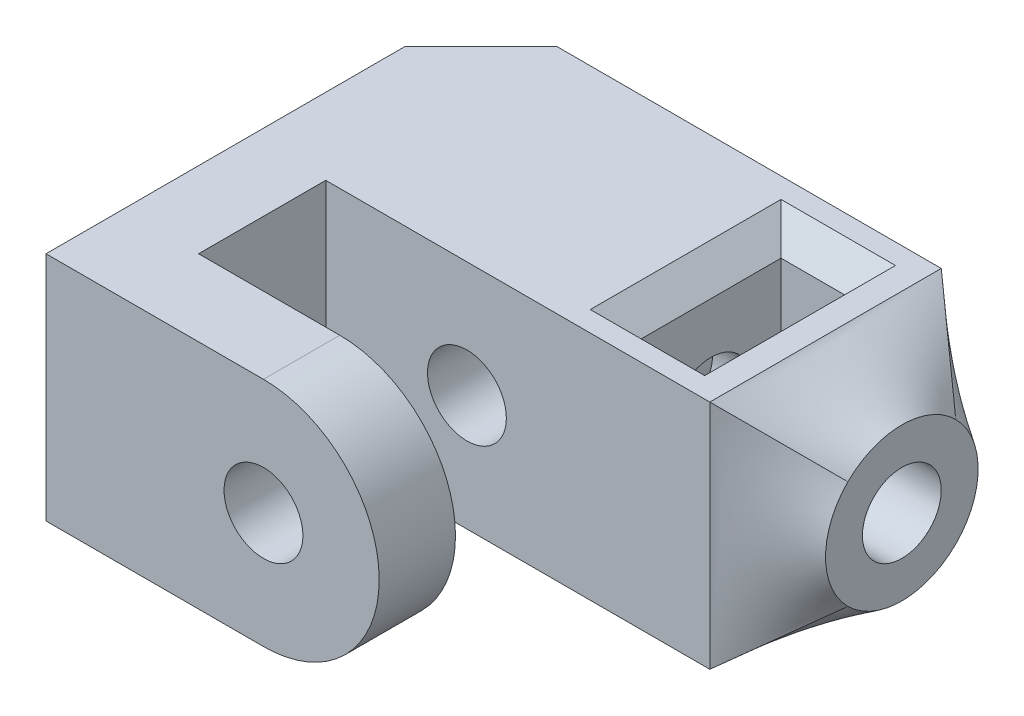
ISO-10303-21;
HEADER;
FILE_DESCRIPTION(('STEP AP214'),'2;1');
FILE_NAME('part.step','',(''),(''),'','','');
FILE_SCHEMA(('AUTOMOTIVE_DESIGN { 1 0 10303 214 1 1 1 1 }'));
ENDSEC;
DATA;
#1=APPLICATION_CONTEXT('core data for automotive mechanical design processes');
#2=APPLICATION_PROTOCOL_DEFINITION('international standard','automotive_design',2000,#1);
#3=PRODUCT_CONTEXT('',#1,'mechanical');
#4=PRODUCT('Part','Part','',(#3));
#5=PRODUCT_RELATED_PRODUCT_CATEGORY('part','',(#4));
#6=PRODUCT_DEFINITION_FORMATION('','',#4);
#7=PRODUCT_DEFINITION_CONTEXT('part definition',#1,'design');
#8=PRODUCT_DEFINITION('design','',#6,#7);
#9=PRODUCT_DEFINITION_SHAPE('','',#8);
#10=(LENGTH_UNIT() NAMED_UNIT(*) SI_UNIT(.MILLI.,.METRE.));
#11=(NAMED_UNIT(*) PLANE_ANGLE_UNIT() SI_UNIT($,.RADIAN.));
#12=(NAMED_UNIT(*) SI_UNIT($,.STERADIAN.) SOLID_ANGLE_UNIT());
#13=UNCERTAINTY_MEASURE_WITH_UNIT(LENGTH_MEASURE(1.E-05),#10,'distance_accuracy_value','');
#14=(GEOMETRIC_REPRESENTATION_CONTEXT(3) GLOBAL_UNCERTAINTY_ASSIGNED_CONTEXT((#13)) GLOBAL_UNIT_ASSIGNED_CONTEXT((#10,
#11,#12)) REPRESENTATION_CONTEXT('',''));
#15=CARTESIAN_POINT('',(0.,0.,0.));
#16=DIRECTION('',(0.,0.,1.));
#17=DIRECTION('',(1.,0.,0.));
#18=AXIS2_PLACEMENT_3D('',#15,#16,#17);
#19=CARTESIAN_POINT('',(-107.11518965689,2.50000000001586,-20.55));
#20=DIRECTION('',(1.,0.,0.));
#21=DIRECTION('',(0.,0.,1.));
#22=AXIS2_PLACEMENT_3D('',#19,#20,#21);
#23=CYLINDRICAL_SURFACE('',#22,1.55);
#24=CARTESIAN_POINT('',(-82.0141896568897,2.50000000001586,-20.55));
#25=DIRECTION('',(-1.,0.,0.));
#26=DIRECTION('',(0.,0.,1.));
#27=AXIS2_PLACEMENT_3D('',#24,#25,#26);
#28=CIRCLE('',#27,1.55);
#29=CARTESIAN_POINT('',(-82.0141896568897,2.50000000001586,-19.));
#30=VERTEX_POINT('',#29);
#31=EDGE_CURVE('E194',#30,#30,#28,.T.);
#32=ORIENTED_EDGE('',*,*,#31,.F.);
#33=EDGE_LOOP('',(#32));
#34=FACE_BOUND('',#33,.T.);
#35=CARTESIAN_POINT('',(-87.0141896568897,2.50000000001586,-20.55));
#36=DIRECTION('',(1.,0.,0.));
#37=DIRECTION('',(0.,0.,-1.));
#38=AXIS2_PLACEMENT_3D('',#35,#36,#37);
#39=CIRCLE('',#38,1.55);
#40=CARTESIAN_POINT('',(-87.0141896568897,2.50000000001586,-22.1));
#41=VERTEX_POINT('',#40);
#42=EDGE_CURVE('E373',#41,#41,#39,.T.);
#43=ORIENTED_EDGE('',*,*,#42,.F.);
#44=EDGE_LOOP('',(#43));
#45=FACE_BOUND('',#44,.T.);
#46=ADVANCED_FACE('F43',(#34,#45),#23,.F.);
#47=CARTESIAN_POINT('',(-100.11418965689,0.,-16.));
#48=DIRECTION('',(-1.,0.,0.));
#49=DIRECTION('',(0.,0.,-1.));
#50=AXIS2_PLACEMENT_3D('',#47,#48,#49);
#51=PLANE('',#50);
#52=DIRECTION('',(0.,1.,0.));
#53=VECTOR('',#52,1.);
#54=CARTESIAN_POINT('',(-100.11418965689,0.,-11.));
#55=LINE('',#54,#53);
#56=CARTESIAN_POINT('',(-100.11418965689,-2.04999999998414,-11.));
#57=VERTEX_POINT('',#56);
#58=CARTESIAN_POINT('',(-100.11418965689,7.05000000001586,-11.));
#59=VERTEX_POINT('',#58);
#60=EDGE_CURVE('E289',#57,#59,#55,.T.);
#61=ORIENTED_EDGE('',*,*,#60,.F.);
#62=DIRECTION('',(0.,0.,-1.));
#63=VECTOR('',#62,1.);
#64=CARTESIAN_POINT('',(-100.11418965689,-2.04999999998414,-8.));
#65=LINE('',#64,#63);
#66=CARTESIAN_POINT('',(-100.11418965689,-2.04999999998414,-16.));
#67=VERTEX_POINT('',#66);
#68=EDGE_CURVE('E299',#57,#67,#65,.T.);
#69=ORIENTED_EDGE('',*,*,#68,.T.);
#70=DIRECTION('',(0.,-1.,0.));
#71=VECTOR('',#70,1.);
#72=CARTESIAN_POINT('',(-100.11418965689,0.,-16.));
#73=LINE('',#72,#71);
#74=CARTESIAN_POINT('',(-100.11418965689,7.05000000001586,-16.));
#75=VERTEX_POINT('',#74);
#76=EDGE_CURVE('E416',#75,#67,#73,.T.);
#77=ORIENTED_EDGE('',*,*,#76,.F.);
#78=DIRECTION('',(0.,0.,1.));
#79=VECTOR('',#78,1.);
#80=CARTESIAN_POINT('',(-100.11418965689,7.05000000001586,-8.));
#81=LINE('',#80,#79);
#82=EDGE_CURVE('E303',#75,#59,#81,.T.);
#83=ORIENTED_EDGE('',*,*,#82,.T.);
#84=EDGE_LOOP('',(#61,#69,#77,#83));
#85=FACE_BOUND('',#84,.T.);
#86=ADVANCED_FACE('F489',(#85),#51,.F.);
#87=CARTESIAN_POINT('',(0.,7.05000000001582,-25.1));
#88=DIRECTION('',(0.,1.,0.));
#89=DIRECTION('',(-1.,0.,0.));
#90=AXIS2_PLACEMENT_3D('',#87,#88,#89);
#91=PLANE('',#90);
#92=DIRECTION('',(0.,0.,1.));
#93=VECTOR('',#92,1.);
#94=CARTESIAN_POINT('',(-90.5141896568897,7.05000000001586,-17.8));
#95=LINE('',#94,#93);
#96=CARTESIAN_POINT('',(-90.5141896568897,7.05000000001586,-24.3));
#97=VERTEX_POINT('',#96);
#98=CARTESIAN_POINT('',(-90.5141896568897,7.05000000001586,-16.8));
#99=VERTEX_POINT('',#98);
#100=EDGE_CURVE('E330',#97,#99,#95,.T.);
#101=ORIENTED_EDGE('',*,*,#100,.F.);
#102=DIRECTION('',(-1.,0.,0.));
#103=VECTOR('',#102,1.);
#104=CARTESIAN_POINT('',(0.,7.05000000001582,-24.3));
#105=LINE('',#104,#103);
#106=CARTESIAN_POINT('',(-86.0141896568897,7.05000000001585,-24.3));
#107=VERTEX_POINT('',#106);
#108=EDGE_CURVE('E343',#107,#97,#105,.T.);
#109=ORIENTED_EDGE('',*,*,#108,.F.);
#110=DIRECTION('',(0.,0.,-1.));
#111=VECTOR('',#110,1.);
#112=CARTESIAN_POINT('',(-86.0141896568897,7.05000000001585,-25.1));
#113=LINE('',#112,#111);
#114=CARTESIAN_POINT('',(-86.0141896568897,7.05000000001586,-16.8));
#115=VERTEX_POINT('',#114);
#116=EDGE_CURVE('E346',#115,#107,#113,.T.);
#117=ORIENTED_EDGE('',*,*,#116,.F.);
#118=DIRECTION('',(1.,0.,0.));
#119=VECTOR('',#118,1.);
#120=CARTESIAN_POINT('',(0.,7.05000000001583,-16.8));
#121=LINE('',#120,#119);
#122=EDGE_CURVE('E349',#99,#115,#121,.T.);
#123=ORIENTED_EDGE('',*,*,#122,.F.);
#124=EDGE_LOOP('',(#101,#109,#117,#123));
#125=FACE_BOUND('',#124,.T.);
#126=DIRECTION('',(0.,0.,1.));
#127=VECTOR('',#126,1.);
#128=CARTESIAN_POINT('',(-103.11418965689,7.05000000001586,-8.));
#129=LINE('',#128,#127);
#130=CARTESIAN_POINT('',(-103.11418965689,7.05000000001586,-22.1));
#131=VERTEX_POINT('',#130);
#132=CARTESIAN_POINT('',(-103.11418965689,7.05000000001586,-8.));
#133=VERTEX_POINT('',#132);
#134=EDGE_CURVE('E306',#131,#133,#129,.T.);
#135=ORIENTED_EDGE('',*,*,#134,.T.);
#136=DIRECTION('',(1.,0.,0.));
#137=VECTOR('',#136,1.);
#138=CARTESIAN_POINT('',(-103.11418965689,7.05000000001586,-8.));
#139=LINE('',#138,#137);
#140=CARTESIAN_POINT('',(-94.5641896568897,7.05000000001586,-8.));
#141=VERTEX_POINT('',#140);
#142=EDGE_CURVE('E309',#133,#141,#139,.T.);
#143=ORIENTED_EDGE('',*,*,#142,.T.);
#144=DIRECTION('',(0.,0.,-1.));
#145=VECTOR('',#144,1.);
#146=CARTESIAN_POINT('',(-94.5641896568897,7.05000000001586,-8.));
#147=LINE('',#146,#145);
#148=CARTESIAN_POINT('',(-94.5641896568897,7.05000000001586,-11.));
#149=VERTEX_POINT('',#148);
#150=EDGE_CURVE('E296',#141,#149,#147,.T.);
#151=ORIENTED_EDGE('',*,*,#150,.T.);
#152=DIRECTION('',(1.,0.,0.));
#153=VECTOR('',#152,1.);
#154=CARTESIAN_POINT('',(0.,7.05000000001586,-11.));
#155=LINE('',#154,#153);
#156=EDGE_CURVE('E281',#59,#149,#155,.T.);
#157=ORIENTED_EDGE('',*,*,#156,.F.);
#158=ORIENTED_EDGE('',*,*,#82,.F.);
#159=DIRECTION('',(1.,0.,0.));
#160=VECTOR('',#159,1.);
#161=CARTESIAN_POINT('',(0.,7.05000000001583,-16.));
#162=LINE('',#161,#160);
#163=CARTESIAN_POINT('',(-85.0141896568897,7.05000000001586,-16.));
#164=VERTEX_POINT('',#163);
#165=EDGE_CURVE('E405',#75,#164,#162,.T.);
#166=ORIENTED_EDGE('',*,*,#165,.T.);
#167=DIRECTION('',(0.,0.,-1.));
#168=VECTOR('',#167,1.);
#169=CARTESIAN_POINT('',(-85.0141896568897,7.05000000001585,-25.1));
#170=LINE('',#169,#168);
#171=CARTESIAN_POINT('',(-85.0141896568897,7.05000000001585,-25.1));
#172=VERTEX_POINT('',#171);
#173=EDGE_CURVE('E331',#172,#164,#170,.F.);
#174=ORIENTED_EDGE('',*,*,#173,.F.);
#175=DIRECTION('',(1.,0.,0.));
#176=VECTOR('',#175,1.);
#177=CARTESIAN_POINT('',(0.,7.05000000001582,-25.1));
#178=LINE('',#177,#176);
#179=CARTESIAN_POINT('',(-100.11418965689,7.05000000001586,-25.1));
#180=VERTEX_POINT('',#179);
#181=EDGE_CURVE('E320',#180,#172,#178,.T.);
#182=ORIENTED_EDGE('',*,*,#181,.F.);
#183=DIRECTION('',(-0.707106781186548,0.,0.707106781186547));
#184=VECTOR('',#183,1.);
#185=CARTESIAN_POINT('',(-50.0570948284447,7.05000000001582,-75.1570948284448));
#186=LINE('',#185,#184);
#187=EDGE_CURVE('E375',#131,#180,#186,.F.);
#188=ORIENTED_EDGE('',*,*,#187,.F.);
#189=EDGE_LOOP('',(#135,#143,#151,#157,#158,#166,#174,#182,#188));
#190=FACE_BOUND('',#189,.T.);
#191=ADVANCED_FACE('F381',(#125,#190),#91,.T.);
#192=CARTESIAN_POINT('',(0.,-2.04999999998411,-25.1));
#193=DIRECTION('',(0.,1.,0.));
#194=DIRECTION('',(-1.,0.,0.));
#195=AXIS2_PLACEMENT_3D('',#192,#193,#194);
#196=PLANE('',#195);
#197=DIRECTION('',(1.,0.,0.));
#198=VECTOR('',#197,1.);
#199=CARTESIAN_POINT('',(0.,-2.04999999998411,-25.1));
#200=LINE('',#199,#198);
#201=CARTESIAN_POINT('',(-100.11418965689,-2.04999999998415,-25.1));
#202=VERTEX_POINT('',#201);
#203=CARTESIAN_POINT('',(-85.0141896568897,-2.04999999998414,-25.1));
#204=VERTEX_POINT('',#203);
#205=EDGE_CURVE('E322',#202,#204,#200,.T.);
#206=ORIENTED_EDGE('',*,*,#205,.T.);
#207=DIRECTION('',(0.,0.,-1.));
#208=VECTOR('',#207,1.);
#209=CARTESIAN_POINT('',(-85.0141896568897,-2.04999999998414,-25.1));
#210=LINE('',#209,#208);
#211=CARTESIAN_POINT('',(-85.0141896568897,-2.04999999998414,-16.));
#212=VERTEX_POINT('',#211);
#213=EDGE_CURVE('E327',#204,#212,#210,.F.);
#214=ORIENTED_EDGE('',*,*,#213,.T.);
#215=DIRECTION('',(1.,0.,0.));
#216=VECTOR('',#215,1.);
#217=CARTESIAN_POINT('',(0.,-2.04999999998411,-16.));
#218=LINE('',#217,#216);
#219=EDGE_CURVE('E335',#67,#212,#218,.T.);
#220=ORIENTED_EDGE('',*,*,#219,.F.);
#221=ORIENTED_EDGE('',*,*,#68,.F.);
#222=DIRECTION('',(-1.,0.,0.));
#223=VECTOR('',#222,1.);
#224=CARTESIAN_POINT('',(0.,-2.04999999998414,-11.));
#225=LINE('',#224,#223);
#226=CARTESIAN_POINT('',(-94.5641896568897,-2.04999999998414,-11.));
#227=VERTEX_POINT('',#226);
#228=EDGE_CURVE('E287',#227,#57,#225,.T.);
#229=ORIENTED_EDGE('',*,*,#228,.F.);
#230=DIRECTION('',(0.,0.,-1.));
#231=VECTOR('',#230,1.);
#232=CARTESIAN_POINT('',(-94.5641896568897,-2.04999999998414,-8.));
#233=LINE('',#232,#231);
#234=CARTESIAN_POINT('',(-94.5641896568897,-2.04999999998414,-8.));
#235=VERTEX_POINT('',#234);
#236=EDGE_CURVE('E280',#235,#227,#233,.T.);
#237=ORIENTED_EDGE('',*,*,#236,.F.);
#238=DIRECTION('',(1.,0.,0.));
#239=VECTOR('',#238,1.);
#240=CARTESIAN_POINT('',(-103.11418965689,-2.04999999998414,-8.));
#241=LINE('',#240,#239);
#242=CARTESIAN_POINT('',(-103.11418965689,-2.04999999998414,-8.));
#243=VERTEX_POINT('',#242);
#244=EDGE_CURVE('E398',#243,#235,#241,.T.);
#245=ORIENTED_EDGE('',*,*,#244,.F.);
#246=DIRECTION('',(0.,0.,-1.));
#247=VECTOR('',#246,1.);
#248=CARTESIAN_POINT('',(-103.11418965689,-2.04999999998414,-8.));
#249=LINE('',#248,#247);
#250=CARTESIAN_POINT('',(-103.11418965689,-2.04999999998415,-22.1));
#251=VERTEX_POINT('',#250);
#252=EDGE_CURVE('E302',#243,#251,#249,.T.);
#253=ORIENTED_EDGE('',*,*,#252,.T.);
#254=DIRECTION('',(0.707106781186548,0.,-0.707106781186547));
#255=VECTOR('',#254,1.);
#256=CARTESIAN_POINT('',(-103.11418965689,-2.04999999998415,-22.1));
#257=LINE('',#256,#255);
#258=EDGE_CURVE('E12',#202,#251,#257,.F.);
#259=ORIENTED_EDGE('',*,*,#258,.F.);
#260=EDGE_LOOP('',(#206,#214,#220,#221,#229,#237,#245,#253,#259));
#261=FACE_BOUND('',#260,.T.);
#262=ADVANCED_FACE('F393',(#261),#196,.F.);
#263=CARTESIAN_POINT('',(-94.5641896568897,2.50000000001586,-25.1));
#264=DIRECTION('',(0.,0.,1.));
#265=DIRECTION('',(-1.,0.,0.));
#266=AXIS2_PLACEMENT_3D('',#263,#264,#265);
#267=CYLINDRICAL_SURFACE('',#266,1.54999999999998);
#268=CARTESIAN_POINT('',(-94.5641896568897,2.50000000001586,-25.1));
#269=DIRECTION('',(0.,0.,1.));
#270=DIRECTION('',(1.,0.,0.));
#271=AXIS2_PLACEMENT_3D('',#268,#269,#270);
#272=CIRCLE('',#271,1.54999999999998);
#273=CARTESIAN_POINT('',(-93.0141896568897,2.50000000001586,-25.1));
#274=VERTEX_POINT('',#273);
#275=EDGE_CURVE('E338',#274,#274,#272,.T.);
#276=ORIENTED_EDGE('',*,*,#275,.F.);
#277=EDGE_LOOP('',(#276));
#278=FACE_BOUND('',#277,.T.);
#279=CARTESIAN_POINT('',(-94.5641896568897,2.50000000001586,-16.));
#280=DIRECTION('',(0.,0.,1.));
#281=DIRECTION('',(1.,0.,0.));
#282=AXIS2_PLACEMENT_3D('',#279,#280,#281);
#283=CIRCLE('',#282,1.54999999999998);
#284=CARTESIAN_POINT('',(-93.0141896568897,2.50000000001586,-16.));
#285=VERTEX_POINT('',#284);
#286=EDGE_CURVE('E323',#285,#285,#283,.T.);
#287=ORIENTED_EDGE('',*,*,#286,.T.);
#288=EDGE_LOOP('',(#287));
#289=FACE_BOUND('',#288,.T.);
#290=ADVANCED_FACE('F497',(#278,#289),#267,.F.);
#291=CARTESIAN_POINT('',(0.,0.,-25.1));
#292=DIRECTION('',(0.,0.,-1.));
#293=DIRECTION('',(1.,0.,0.));
#294=AXIS2_PLACEMENT_3D('',#291,#292,#293);
#295=PLANE('',#294);
#296=ORIENTED_EDGE('',*,*,#181,.T.);
#297=DIRECTION('',(0.,1.,0.));
#298=VECTOR('',#297,1.);
#299=CARTESIAN_POINT('',(-85.0141896568897,0.,-25.1));
#300=LINE('',#299,#298);
#301=EDGE_CURVE('E326',#204,#172,#300,.T.);
#302=ORIENTED_EDGE('',*,*,#301,.F.);
#303=ORIENTED_EDGE('',*,*,#205,.F.);
#304=DIRECTION('',(0.,-1.,0.));
#305=VECTOR('',#304,1.);
#306=CARTESIAN_POINT('',(-100.11418965689,0.,-25.1));
#307=LINE('',#306,#305);
#308=EDGE_CURVE('E51',#180,#202,#307,.T.);
#309=ORIENTED_EDGE('',*,*,#308,.F.);
#310=EDGE_LOOP('',(#296,#302,#303,#309));
#311=FACE_BOUND('',#310,.T.);
#312=ORIENTED_EDGE('',*,*,#275,.T.);
#313=EDGE_LOOP('',(#312));
#314=FACE_BOUND('',#313,.T.);
#315=ADVANCED_FACE('F384',(#311,#314),#295,.T.);
#316=CARTESIAN_POINT('',(0.,0.,-16.));
#317=DIRECTION('',(0.,0.,-1.));
#318=DIRECTION('',(1.,0.,0.));
#319=AXIS2_PLACEMENT_3D('',#316,#317,#318);
#320=PLANE('',#319);
#321=ORIENTED_EDGE('',*,*,#165,.F.);
#322=ORIENTED_EDGE('',*,*,#76,.T.);
#323=ORIENTED_EDGE('',*,*,#219,.T.);
#324=DIRECTION('',(0.,1.,0.));
#325=VECTOR('',#324,1.);
#326=CARTESIAN_POINT('',(-85.0141896568897,0.,-16.));
#327=LINE('',#326,#325);
#328=EDGE_CURVE('E332',#212,#164,#327,.T.);
#329=ORIENTED_EDGE('',*,*,#328,.T.);
#330=EDGE_LOOP('',(#321,#322,#323,#329));
#331=FACE_BOUND('',#330,.T.);
#332=ORIENTED_EDGE('',*,*,#286,.F.);
#333=EDGE_LOOP('',(#332));
#334=FACE_BOUND('',#333,.T.);
#335=ADVANCED_FACE('F423',(#331,#334),#320,.F.);
#336=CARTESIAN_POINT('',(-103.11418965689,7.05000000001586,-8.));
#337=DIRECTION('',(0.,0.,-1.));
#338=DIRECTION('',(0.,-1.,0.));
#339=AXIS2_PLACEMENT_3D('',#336,#337,#338);
#340=PLANE('',#339);
#341=ORIENTED_EDGE('',*,*,#142,.F.);
#342=DIRECTION('',(0.,-1.,0.));
#343=VECTOR('',#342,1.);
#344=CARTESIAN_POINT('',(-103.11418965689,7.05000000001586,-8.));
#345=LINE('',#344,#343);
#346=EDGE_CURVE('E300',#133,#243,#345,.T.);
#347=ORIENTED_EDGE('',*,*,#346,.T.);
#348=ORIENTED_EDGE('',*,*,#244,.T.);
#349=CARTESIAN_POINT('',(-94.5641896568897,2.50000000001586,-8.));
#350=DIRECTION('',(0.,0.,-1.));
#351=DIRECTION('',(-1.,0.,0.));
#352=AXIS2_PLACEMENT_3D('',#349,#350,#351);
#353=CIRCLE('',#352,4.55);
#354=EDGE_CURVE('E269',#141,#235,#353,.T.);
#355=ORIENTED_EDGE('',*,*,#354,.F.);
#356=EDGE_LOOP('',(#341,#347,#348,#355));
#357=FACE_BOUND('',#356,.T.);
#358=CARTESIAN_POINT('',(-94.5641896568897,2.50000000001586,-8.));
#359=DIRECTION('',(0.,0.,-1.));
#360=DIRECTION('',(-1.,0.,0.));
#361=AXIS2_PLACEMENT_3D('',#358,#359,#360);
#362=CIRCLE('',#361,1.54999999999998);
#363=CARTESIAN_POINT('',(-96.1141896568897,2.50000000001586,-8.));
#364=VERTEX_POINT('',#363);
#365=EDGE_CURVE('E276',#364,#364,#362,.T.);
#366=ORIENTED_EDGE('',*,*,#365,.T.);
#367=EDGE_LOOP('',(#366));
#368=FACE_BOUND('',#367,.T.);
#369=ADVANCED_FACE('F488',(#357,#368),#340,.F.);
#370=CARTESIAN_POINT('',(-103.11418965689,0.,-16.));
#371=DIRECTION('',(-1.,0.,0.));
#372=DIRECTION('',(0.,0.,-1.));
#373=AXIS2_PLACEMENT_3D('',#370,#371,#372);
#374=PLANE('',#373);
#375=ORIENTED_EDGE('',*,*,#252,.F.);
#376=ORIENTED_EDGE('',*,*,#346,.F.);
#377=ORIENTED_EDGE('',*,*,#134,.F.);
#378=DIRECTION('',(0.,1.,0.));
#379=VECTOR('',#378,1.);
#380=CARTESIAN_POINT('',(-103.11418965689,0.,-22.1));
#381=LINE('',#380,#379);
#382=EDGE_CURVE('E364',#251,#131,#381,.T.);
#383=ORIENTED_EDGE('',*,*,#382,.F.);
#384=EDGE_LOOP('',(#375,#376,#377,#383));
#385=FACE_BOUND('',#384,.T.);
#386=ADVANCED_FACE('F400',(#385),#374,.T.);
#387=CARTESIAN_POINT('',(-94.5641896568897,2.50000000001586,-8.));
#388=DIRECTION('',(0.,0.,-1.));
#389=DIRECTION('',(1.,0.,0.));
#390=AXIS2_PLACEMENT_3D('',#387,#388,#389);
#391=CYLINDRICAL_SURFACE('',#390,4.55);
#392=CARTESIAN_POINT('',(-94.5641896568897,2.50000000001586,-11.));
#393=DIRECTION('',(0.,0.,-1.));
#394=DIRECTION('',(-1.,0.,0.));
#395=AXIS2_PLACEMENT_3D('',#392,#393,#394);
#396=CIRCLE('',#395,4.55);
#397=EDGE_CURVE('E284',#149,#227,#396,.T.);
#398=ORIENTED_EDGE('',*,*,#397,.F.);
#399=ORIENTED_EDGE('',*,*,#150,.F.);
#400=ORIENTED_EDGE('',*,*,#354,.T.);
#401=ORIENTED_EDGE('',*,*,#236,.T.);
#402=EDGE_LOOP('',(#398,#399,#400,#401));
#403=FACE_BOUND('',#402,.T.);
#404=ADVANCED_FACE('F481',(#403),#391,.T.);
#405=CARTESIAN_POINT('',(-94.5641896568897,2.50000000001586,-8.));
#406=DIRECTION('',(0.,0.,-1.));
#407=DIRECTION('',(1.,0.,0.));
#408=AXIS2_PLACEMENT_3D('',#405,#406,#407);
#409=CYLINDRICAL_SURFACE('',#408,1.54999999999998);
#410=ORIENTED_EDGE('',*,*,#365,.F.);
#411=EDGE_LOOP('',(#410));
#412=FACE_BOUND('',#411,.T.);
#413=CARTESIAN_POINT('',(-94.5641896568897,2.50000000001586,-11.));
#414=DIRECTION('',(0.,0.,-1.));
#415=DIRECTION('',(-1.,0.,0.));
#416=AXIS2_PLACEMENT_3D('',#413,#414,#415);
#417=CIRCLE('',#416,1.54999999999998);
#418=CARTESIAN_POINT('',(-96.1141896568897,2.50000000001586,-11.));
#419=VERTEX_POINT('',#418);
#420=EDGE_CURVE('E277',#419,#419,#417,.T.);
#421=ORIENTED_EDGE('',*,*,#420,.T.);
#422=EDGE_LOOP('',(#421));
#423=FACE_BOUND('',#422,.T.);
#424=ADVANCED_FACE('F477',(#412,#423),#409,.F.);
#425=CARTESIAN_POINT('',(0.,0.,-11.));
#426=DIRECTION('',(0.,0.,1.));
#427=DIRECTION('',(-1.,0.,0.));
#428=AXIS2_PLACEMENT_3D('',#425,#426,#427);
#429=PLANE('',#428);
#430=ORIENTED_EDGE('',*,*,#156,.T.);
#431=ORIENTED_EDGE('',*,*,#397,.T.);
#432=ORIENTED_EDGE('',*,*,#228,.T.);
#433=ORIENTED_EDGE('',*,*,#60,.T.);
#434=EDGE_LOOP('',(#430,#431,#432,#433));
#435=FACE_BOUND('',#434,.T.);
#436=ORIENTED_EDGE('',*,*,#420,.F.);
#437=EDGE_LOOP('',(#436));
#438=FACE_BOUND('',#437,.T.);
#439=ADVANCED_FACE('F226',(#435,#438),#429,.F.);
#440=CARTESIAN_POINT('',(-82.0141896568897,2.50000000001586,-20.55));
#441=DIRECTION('',(1.,0.,0.));
#442=DIRECTION('',(0.,0.,1.));
#443=AXIS2_PLACEMENT_3D('',#440,#441,#442);
#444=PLANE('',#443);
#445=ORIENTED_EDGE('',*,*,#31,.T.);
#446=EDGE_LOOP('',(#445));
#447=FACE_BOUND('',#446,.T.);
#448=CARTESIAN_POINT('',(-82.0141896568897,2.50000000001586,-20.55));
#449=DIRECTION('',(-1.,0.,0.));
#450=DIRECTION('',(0.,0.,1.));
#451=AXIS2_PLACEMENT_3D('',#448,#449,#450);
#452=CIRCLE('',#451,3.);
#453=CARTESIAN_POINT('',(-82.0141896568897,0.378679656456214,-18.4286796564404));
#454=VERTEX_POINT('',#453);
#455=CARTESIAN_POINT('',(-82.0141896568897,4.6213203435755,-18.4286796564404));
#456=VERTEX_POINT('',#455);
#457=EDGE_CURVE('E285',#454,#456,#452,.T.);
#458=ORIENTED_EDGE('',*,*,#457,.F.);
#459=CARTESIAN_POINT('',(-82.0141896568897,0.378679656456214,-22.6713203435596));
#460=VERTEX_POINT('',#459);
#461=EDGE_CURVE('E261',#460,#454,#452,.T.);
#462=ORIENTED_EDGE('',*,*,#461,.F.);
#463=CARTESIAN_POINT('',(-82.0141896568897,4.6213203435755,-22.6713203435596));
#464=VERTEX_POINT('',#463);
#465=EDGE_CURVE('E252',#464,#460,#452,.T.);
#466=ORIENTED_EDGE('',*,*,#465,.F.);
#467=EDGE_CURVE('E260',#456,#464,#452,.T.);
#468=ORIENTED_EDGE('',*,*,#467,.F.);
#469=EDGE_LOOP('',(#458,#462,#466,#468));
#470=FACE_BOUND('',#469,.T.);
#471=ADVANCED_FACE('F221',(#447,#470),#444,.T.);
#472=CARTESIAN_POINT('',(-85.0141896568897,-2.04999999998414,-25.1));
#473=CARTESIAN_POINT('',(-82.0141896568897,0.378679656456214,-22.6713203435596));
#474=CARTESIAN_POINT('',(-85.0141896568897,-2.04999999998414,-24.3416666666667));
#475=CARTESIAN_POINT('',(-82.0141896568897,0.128679656456214,-22.4213203435596));
#476=CARTESIAN_POINT('',(-85.0141896568897,-2.04999999998414,-23.5833333333333));
#477=CARTESIAN_POINT('',(-82.0141896568897,-0.0954757886155162,-22.1060383272898));
#478=CARTESIAN_POINT('',(-85.0141896568897,-2.04999999998414,-22.0666666666667));
#479=CARTESIAN_POINT('',(-82.0141896568897,-0.410975479348312,-21.3770257577047));
#480=CARTESIAN_POINT('',(-85.0141896568897,-2.04999999998414,-21.3083333333333));
#481=CARTESIAN_POINT('',(-82.0141896568897,-0.499999999984144,-20.9642135623731));
#482=CARTESIAN_POINT('',(-85.0141896568897,-2.04999999998414,-19.7916666666667));
#483=CARTESIAN_POINT('',(-82.0141896568897,-0.499999999984144,-20.1357864376269));
#484=CARTESIAN_POINT('',(-85.0141896568897,-2.04999999998414,-19.0333333333333));
#485=CARTESIAN_POINT('',(-82.0141896568897,-0.410975479348312,-19.7229742422953));
#486=CARTESIAN_POINT('',(-85.0141896568897,-2.04999999998414,-17.5166666666667));
#487=CARTESIAN_POINT('',(-82.0141896568897,-0.0954757886155162,-18.9939616727102));
#488=CARTESIAN_POINT('',(-85.0141896568897,-2.04999999998414,-16.7583333333333));
#489=CARTESIAN_POINT('',(-82.0141896568897,0.128679656456214,-18.6786796564404));
#490=CARTESIAN_POINT('',(-85.0141896568897,-2.04999999998414,-16.));
#491=CARTESIAN_POINT('',(-82.0141896568897,0.378679656456214,-18.4286796564404));
#492=B_SPLINE_SURFACE_WITH_KNOTS('',3,1,((#472,#473),(#474,#475),(#476,#477),(#478,#479),(#480,
#481),(#482,#483),(#484,#485),(#486,#487),(#488,#489),(#490,#491)),.UNSPECIFIED.,.F.,.F.,.F.,(4,
2,2,2,4),(2,2),(0.,0.25,0.5,0.75,1.),(0.,1.),.UNSPECIFIED.);
#493=DIRECTION('',(-0.657841435116081,-0.532562036876651,-0.532562036876651));
#494=VECTOR('',#493,1.);
#495=CARTESIAN_POINT('',(-83.5141896568897,-0.835660171763965,-23.8856601717798));
#496=LINE('',#495,#494);
#497=EDGE_CURVE('E389',#460,#204,#496,.T.);
#498=DIRECTION('',(0.657841435116081,0.53256203687665,-0.532562036876652));
#499=VECTOR('',#498,1.);
#500=CARTESIAN_POINT('',(-83.5141896568897,-0.835660171763963,-17.2143398282202));
#501=LINE('',#500,#499);
#502=EDGE_CURVE('E390',#212,#454,#501,.T.);
#503=ORIENTED_EDGE('',*,*,#213,.F.);
#504=ORIENTED_EDGE('',*,*,#497,.F.);
#505=ORIENTED_EDGE('',*,*,#461,.T.);
#506=ORIENTED_EDGE('',*,*,#502,.F.);
#507=EDGE_LOOP('',(#503,#504,#505,#506));
#508=FACE_BOUND('',#507,.T.);
#509=ADVANCED_FACE('F225',(#508),#492,.F.);
#510=CARTESIAN_POINT('',(-85.0141896568897,-2.04999999998414,-16.));
#511=CARTESIAN_POINT('',(-82.0141896568897,0.378679656456214,-18.4286796564404));
#512=CARTESIAN_POINT('',(-85.0141896568897,-1.29166666665081,-16.));
#513=CARTESIAN_POINT('',(-82.0141896568897,0.628679656456214,-18.1786796564404));
#514=CARTESIAN_POINT('',(-85.0141896568897,-0.533333333317472,-16.));
#515=CARTESIAN_POINT('',(-82.0141896568897,0.943961672726084,-17.9545242113686));
#516=CARTESIAN_POINT('',(-85.0141896568897,0.983333333349195,-16.));
#517=CARTESIAN_POINT('',(-82.0141896568897,1.6729742423112,-17.6390245206358));
#518=CARTESIAN_POINT('',(-85.0141896568897,1.74166666668253,-16.));
#519=CARTESIAN_POINT('',(-82.0141896568897,2.08578643764276,-17.55));
#520=CARTESIAN_POINT('',(-85.0141896568897,3.25833333334919,-16.));
#521=CARTESIAN_POINT('',(-82.0141896568897,2.91421356238895,-17.55));
#522=CARTESIAN_POINT('',(-85.0141896568897,4.01666666668253,-16.));
#523=CARTESIAN_POINT('',(-82.0141896568897,3.32702575772051,-17.6390245206358));
#524=CARTESIAN_POINT('',(-85.0141896568897,5.53333333334919,-16.));
#525=CARTESIAN_POINT('',(-82.0141896568898,4.05603832730563,-17.9545242113686));
#526=CARTESIAN_POINT('',(-85.0141896568897,6.29166666668252,-16.));
#527=CARTESIAN_POINT('',(-82.0141896568897,4.3713203435755,-18.1786796564404));
#528=CARTESIAN_POINT('',(-85.0141896568897,7.05000000001586,-16.));
#529=CARTESIAN_POINT('',(-82.0141896568897,4.6213203435755,-18.4286796564404));
#530=B_SPLINE_SURFACE_WITH_KNOTS('',3,1,((#510,#511),(#512,#513),(#514,#515),(#516,#517),(#518,
#519),(#520,#521),(#522,#523),(#524,#525),(#526,#527),(#528,#529)),.UNSPECIFIED.,.F.,.F.,.F.,(4,
2,2,2,4),(2,2),(0.,0.25,0.5,0.75,1.),(0.,1.),.UNSPECIFIED.);
#531=DIRECTION('',(0.657841435116081,-0.532562036876651,-0.532562036876651));
#532=VECTOR('',#531,1.);
#533=CARTESIAN_POINT('',(-83.5141896568897,5.83566017179568,-17.2143398282202));
#534=LINE('',#533,#532);
#535=EDGE_CURVE('E430',#164,#456,#534,.T.);
#536=ORIENTED_EDGE('',*,*,#328,.F.);
#537=ORIENTED_EDGE('',*,*,#502,.T.);
#538=ORIENTED_EDGE('',*,*,#457,.T.);
#539=ORIENTED_EDGE('',*,*,#535,.F.);
#540=EDGE_LOOP('',(#536,#537,#538,#539));
#541=FACE_BOUND('',#540,.T.);
#542=ADVANCED_FACE('F668',(#541),#530,.F.);
#543=CARTESIAN_POINT('',(-85.0141896568897,7.05000000001585,-25.1));
#544=CARTESIAN_POINT('',(-82.0141896568897,4.6213203435755,-22.6713203435596));
#545=CARTESIAN_POINT('',(-85.0141896568897,6.29166666668252,-25.1));
#546=CARTESIAN_POINT('',(-82.0141896568897,4.3713203435755,-22.9213203435596));
#547=CARTESIAN_POINT('',(-85.0141896568897,5.53333333334919,-25.1));
#548=CARTESIAN_POINT('',(-82.0141896568897,4.05603832730563,-23.1454757886314));
#549=CARTESIAN_POINT('',(-85.0141896568897,4.01666666668253,-25.1));
#550=CARTESIAN_POINT('',(-82.0141896568897,3.32702575772051,-23.4609754793642));
#551=CARTESIAN_POINT('',(-85.0141896568897,3.25833333334919,-25.1));
#552=CARTESIAN_POINT('',(-82.0141896568897,2.91421356238895,-23.55));
#553=CARTESIAN_POINT('',(-85.0141896568897,1.74166666668253,-25.1));
#554=CARTESIAN_POINT('',(-82.0141896568897,2.08578643764276,-23.55));
#555=CARTESIAN_POINT('',(-85.0141896568897,0.983333333349194,-25.1));
#556=CARTESIAN_POINT('',(-82.0141896568897,1.6729742423112,-23.4609754793642));
#557=CARTESIAN_POINT('',(-85.0141896568897,-0.533333333317474,-25.1));
#558=CARTESIAN_POINT('',(-82.0141896568897,0.943961672726084,-23.1454757886314));
#559=CARTESIAN_POINT('',(-85.0141896568897,-1.29166666665081,-25.1));
#560=CARTESIAN_POINT('',(-82.0141896568897,0.628679656456214,-22.9213203435596));
#561=CARTESIAN_POINT('',(-85.0141896568897,-2.04999999998414,-25.1));
#562=CARTESIAN_POINT('',(-82.0141896568897,0.378679656456214,-22.6713203435596));
#563=B_SPLINE_SURFACE_WITH_KNOTS('',3,1,((#543,#544),(#545,#546),(#547,#548),(#549,#550),(#551,
#552),(#553,#554),(#555,#556),(#557,#558),(#559,#560),(#561,#562)),.UNSPECIFIED.,.F.,.F.,.F.,(4,
2,2,2,4),(2,2),(0.,0.25,0.5,0.75,1.),(0.,1.),.UNSPECIFIED.);
#564=DIRECTION('',(0.657841435116081,-0.532562036876651,0.532562036876651));
#565=VECTOR('',#564,1.);
#566=CARTESIAN_POINT('',(-83.5141896568897,5.83566017179568,-23.8856601717798));
#567=LINE('',#566,#565);
#568=EDGE_CURVE('E209',#172,#464,#567,.T.);
#569=ORIENTED_EDGE('',*,*,#301,.T.);
#570=ORIENTED_EDGE('',*,*,#568,.T.);
#571=ORIENTED_EDGE('',*,*,#465,.T.);
#572=ORIENTED_EDGE('',*,*,#497,.T.);
#573=EDGE_LOOP('',(#569,#570,#571,#572));
#574=FACE_BOUND('',#573,.T.);
#575=ADVANCED_FACE('F466',(#574),#563,.F.);
#576=CARTESIAN_POINT('',(-85.0141896568897,7.05000000001586,-16.));
#577=CARTESIAN_POINT('',(-82.0141896568897,4.6213203435755,-18.4286796564404));
#578=CARTESIAN_POINT('',(-85.0141896568897,7.05000000001586,-16.7583333333333));
#579=CARTESIAN_POINT('',(-82.0141896568897,4.8713203435755,-18.6786796564404));
#580=CARTESIAN_POINT('',(-85.0141896568897,7.05000000001586,-17.5166666666667));
#581=CARTESIAN_POINT('',(-82.0141896568897,5.09547578864723,-18.9939616727102));
#582=CARTESIAN_POINT('',(-85.0141896568897,7.05000000001586,-19.0333333333333));
#583=CARTESIAN_POINT('',(-82.0141896568897,5.41097547938002,-19.7229742422953));
#584=CARTESIAN_POINT('',(-85.0141896568897,7.05000000001585,-19.7916666666667));
#585=CARTESIAN_POINT('',(-82.0141896568897,5.50000000001586,-20.1357864376269));
#586=CARTESIAN_POINT('',(-85.0141896568897,7.05000000001585,-21.3083333333333));
#587=CARTESIAN_POINT('',(-82.0141896568897,5.50000000001585,-20.9642135623731));
#588=CARTESIAN_POINT('',(-85.0141896568897,7.05000000001585,-22.0666666666667));
#589=CARTESIAN_POINT('',(-82.0141896568897,5.41097547938003,-21.3770257577047));
#590=CARTESIAN_POINT('',(-85.0141896568897,7.05000000001585,-23.5833333333333));
#591=CARTESIAN_POINT('',(-82.0141896568897,5.09547578864723,-22.1060383272898));
#592=CARTESIAN_POINT('',(-85.0141896568897,7.05000000001585,-24.3416666666667));
#593=CARTESIAN_POINT('',(-82.0141896568897,4.8713203435755,-22.4213203435596));
#594=CARTESIAN_POINT('',(-85.0141896568897,7.05000000001585,-25.1));
#595=CARTESIAN_POINT('',(-82.0141896568897,4.6213203435755,-22.6713203435596));
#596=B_SPLINE_SURFACE_WITH_KNOTS('',3,1,((#576,#577),(#578,#579),(#580,#581),(#582,#583),(#584,
#585),(#586,#587),(#588,#589),(#590,#591),(#592,#593),(#594,#595)),.UNSPECIFIED.,.F.,.F.,.F.,(4,
2,2,2,4),(2,2),(0.,0.25,0.5,0.75,1.),(0.,1.),.UNSPECIFIED.);
#597=ORIENTED_EDGE('',*,*,#173,.T.);
#598=ORIENTED_EDGE('',*,*,#535,.T.);
#599=ORIENTED_EDGE('',*,*,#467,.T.);
#600=ORIENTED_EDGE('',*,*,#568,.F.);
#601=EDGE_LOOP('',(#597,#598,#599,#600));
#602=FACE_BOUND('',#601,.T.);
#603=ADVANCED_FACE('F428',(#602),#596,.F.);
#604=CARTESIAN_POINT('',(-89.5141896568897,1.46363793321427,-16.8450317547374));
#605=DIRECTION('',(0.,0.866025403784438,-0.5));
#606=DIRECTION('',(0.,-0.5,-0.866025403784438));
#607=AXIS2_PLACEMENT_3D('',#604,#605,#606);
#608=PLANE('',#607);
#609=DIRECTION('',(0.,-0.5,-0.866025403784438));
#610=VECTOR('',#609,1.);
#611=CARTESIAN_POINT('',(-87.0141896568897,1.46363793321427,-16.8450317547374));
#612=LINE('',#611,#610);
#613=CARTESIAN_POINT('',(-87.0141896568897,0.912286759744374,-17.8));
#614=VERTEX_POINT('',#613);
#615=CARTESIAN_POINT('',(-87.0141896568897,-0.67542648052711,-20.55));
#616=VERTEX_POINT('',#615);
#617=EDGE_CURVE('E193',#614,#616,#612,.T.);
#618=ORIENTED_EDGE('',*,*,#617,.T.);
#619=DIRECTION('',(1.,0.,0.));
#620=VECTOR('',#619,1.);
#621=CARTESIAN_POINT('',(-89.5141896568897,-0.67542648052711,-20.55));
#622=LINE('',#621,#620);
#623=CARTESIAN_POINT('',(-89.5141896568897,-0.67542648052711,-20.55));
#624=VERTEX_POINT('',#623);
#625=EDGE_CURVE('E172',#624,#616,#622,.T.);
#626=ORIENTED_EDGE('',*,*,#625,.F.);
#627=DIRECTION('',(0.,-0.5,-0.866025403784438));
#628=VECTOR('',#627,1.);
#629=CARTESIAN_POINT('',(-89.5141896568897,1.46363793321427,-16.8450317547374));
#630=LINE('',#629,#628);
#631=CARTESIAN_POINT('',(-89.5141896568897,0.912286759744374,-17.8));
#632=VERTEX_POINT('',#631);
#633=EDGE_CURVE('E179',#632,#624,#630,.T.);
#634=ORIENTED_EDGE('',*,*,#633,.F.);
#635=DIRECTION('',(1.,0.,0.));
#636=VECTOR('',#635,1.);
#637=CARTESIAN_POINT('',(-89.5141896568897,0.912286759744374,-17.8));
#638=LINE('',#637,#636);
#639=EDGE_CURVE('E199',#632,#614,#638,.T.);
#640=ORIENTED_EDGE('',*,*,#639,.T.);
#641=EDGE_LOOP('',(#618,#626,#634,#640));
#642=FACE_BOUND('',#641,.T.);
#643=ADVANCED_FACE('F191',(#642),#608,.T.);
#644=CARTESIAN_POINT('',(-89.5141896568897,-2.47677765400493,-17.4299682452626));
#645=DIRECTION('',(0.,0.866025403784439,0.5));
#646=DIRECTION('',(0.,0.5,-0.866025403784439));
#647=AXIS2_PLACEMENT_3D('',#644,#645,#646);
#648=PLANE('',#647);
#649=DIRECTION('',(0.,0.5,-0.866025403784439));
#650=VECTOR('',#649,1.);
#651=CARTESIAN_POINT('',(-87.0141896568897,-2.47677765400493,-17.4299682452626));
#652=LINE('',#651,#650);
#653=CARTESIAN_POINT('',(-87.0141896568897,0.912286759744372,-23.3));
#654=VERTEX_POINT('',#653);
#655=EDGE_CURVE('E533',#616,#654,#652,.T.);
#656=ORIENTED_EDGE('',*,*,#655,.T.);
#657=DIRECTION('',(1.,0.,0.));
#658=VECTOR('',#657,1.);
#659=CARTESIAN_POINT('',(-89.5141896568897,0.912286759744372,-23.3));
#660=LINE('',#659,#658);
#661=CARTESIAN_POINT('',(-89.5141896568897,0.912286759744372,-23.3));
#662=VERTEX_POINT('',#661);
#663=EDGE_CURVE('E175',#662,#654,#660,.T.);
#664=ORIENTED_EDGE('',*,*,#663,.F.);
#665=DIRECTION('',(0.,0.5,-0.866025403784439));
#666=VECTOR('',#665,1.);
#667=CARTESIAN_POINT('',(-89.5141896568897,-2.47677765400493,-17.4299682452626));
#668=LINE('',#667,#666);
#669=EDGE_CURVE('E167',#624,#662,#668,.T.);
#670=ORIENTED_EDGE('',*,*,#669,.F.);
#671=ORIENTED_EDGE('',*,*,#625,.T.);
#672=EDGE_LOOP('',(#656,#664,#670,#671));
#673=FACE_BOUND('',#672,.T.);
#674=ADVANCED_FACE('F170',(#673),#648,.T.);
#675=CARTESIAN_POINT('',(-89.5141896568897,0.,-23.3));
#676=DIRECTION('',(0.,0.,1.));
#677=DIRECTION('',(-1.,0.,0.));
#678=AXIS2_PLACEMENT_3D('',#675,#676,#677);
#679=PLANE('',#678);
#680=DIRECTION('',(0.,1.,0.));
#681=VECTOR('',#680,1.);
#682=CARTESIAN_POINT('',(-89.5141896568897,0.,-23.3));
#683=LINE('',#682,#681);
#684=CARTESIAN_POINT('',(-89.5141896568897,6.05000000001587,-23.3));
#685=VERTEX_POINT('',#684);
#686=EDGE_CURVE('E178',#662,#685,#683,.T.);
#687=ORIENTED_EDGE('',*,*,#686,.F.);
#688=ORIENTED_EDGE('',*,*,#663,.T.);
#689=DIRECTION('',(0.,1.,0.));
#690=VECTOR('',#689,1.);
#691=CARTESIAN_POINT('',(-87.0141896568897,0.,-23.3));
#692=LINE('',#691,#690);
#693=CARTESIAN_POINT('',(-87.0141896568897,6.05000000001586,-23.3));
#694=VERTEX_POINT('',#693);
#695=EDGE_CURVE('E539',#654,#694,#692,.T.);
#696=ORIENTED_EDGE('',*,*,#695,.T.);
#697=DIRECTION('',(1.,0.,0.));
#698=VECTOR('',#697,1.);
#699=CARTESIAN_POINT('',(-89.5141896568897,6.05000000001586,-23.3));
#700=LINE('',#699,#698);
#701=EDGE_CURVE('E358',#685,#694,#700,.T.);
#702=ORIENTED_EDGE('',*,*,#701,.F.);
#703=EDGE_LOOP('',(#687,#688,#696,#702));
#704=FACE_BOUND('',#703,.T.);
#705=ADVANCED_FACE('F557',(#704),#679,.T.);
#706=CARTESIAN_POINT('',(-89.5141896568897,0.,-17.8));
#707=DIRECTION('',(0.,0.,-1.));
#708=DIRECTION('',(0.,-1.,0.));
#709=AXIS2_PLACEMENT_3D('',#706,#707,#708);
#710=PLANE('',#709);
#711=DIRECTION('',(0.,-1.,0.));
#712=VECTOR('',#711,1.);
#713=CARTESIAN_POINT('',(-87.0141896568897,0.,-17.8));
#714=LINE('',#713,#712);
#715=CARTESIAN_POINT('',(-87.0141896568897,6.05000000001586,-17.8));
#716=VERTEX_POINT('',#715);
#717=EDGE_CURVE('E542',#716,#614,#714,.T.);
#718=ORIENTED_EDGE('',*,*,#717,.T.);
#719=ORIENTED_EDGE('',*,*,#639,.F.);
#720=DIRECTION('',(0.,-1.,0.));
#721=VECTOR('',#720,1.);
#722=CARTESIAN_POINT('',(-89.5141896568897,0.,-17.8));
#723=LINE('',#722,#721);
#724=CARTESIAN_POINT('',(-89.5141896568897,6.05000000001587,-17.8));
#725=VERTEX_POINT('',#724);
#726=EDGE_CURVE('E185',#725,#632,#723,.T.);
#727=ORIENTED_EDGE('',*,*,#726,.F.);
#728=DIRECTION('',(-1.,0.,0.));
#729=VECTOR('',#728,1.);
#730=CARTESIAN_POINT('',(-89.5141896568897,6.05000000001587,-17.8));
#731=LINE('',#730,#729);
#732=EDGE_CURVE('E352',#716,#725,#731,.T.);
#733=ORIENTED_EDGE('',*,*,#732,.F.);
#734=EDGE_LOOP('',(#718,#719,#727,#733));
#735=FACE_BOUND('',#734,.T.);
#736=ADVANCED_FACE('F550',(#735),#710,.T.);
#737=CARTESIAN_POINT('',(-89.5141896568897,0.,-16.));
#738=DIRECTION('',(-1.,0.,0.));
#739=DIRECTION('',(0.,0.,-1.));
#740=AXIS2_PLACEMENT_3D('',#737,#738,#739);
#741=PLANE('',#740);
#742=CARTESIAN_POINT('',(-89.5141896568897,2.50000000001586,-20.55));
#743=DIRECTION('',(1.,0.,0.));
#744=DIRECTION('',(0.,0.,-1.));
#745=AXIS2_PLACEMENT_3D('',#742,#743,#744);
#746=CIRCLE('',#745,1.55);
#747=CARTESIAN_POINT('',(-89.5141896568897,2.50000000001586,-22.1));
#748=VERTEX_POINT('',#747);
#749=EDGE_CURVE('E189',#748,#748,#746,.T.);
#750=ORIENTED_EDGE('',*,*,#749,.F.);
#751=EDGE_LOOP('',(#750));
#752=FACE_BOUND('',#751,.T.);
#753=ORIENTED_EDGE('',*,*,#726,.T.);
#754=ORIENTED_EDGE('',*,*,#633,.T.);
#755=ORIENTED_EDGE('',*,*,#669,.T.);
#756=ORIENTED_EDGE('',*,*,#686,.T.);
#757=DIRECTION('',(0.,0.,-1.));
#758=VECTOR('',#757,1.);
#759=CARTESIAN_POINT('',(-89.5141896568897,6.05000000001587,-23.3));
#760=LINE('',#759,#758);
#761=EDGE_CURVE('E361',#725,#685,#760,.T.);
#762=ORIENTED_EDGE('',*,*,#761,.F.);
#763=EDGE_LOOP('',(#753,#754,#755,#756,#762));
#764=FACE_BOUND('',#763,.T.);
#765=ADVANCED_FACE('F182',(#752,#764),#741,.F.);
#766=CARTESIAN_POINT('',(-87.0141896568897,0.,-16.));
#767=DIRECTION('',(-1.,0.,0.));
#768=DIRECTION('',(0.,0.,-1.));
#769=AXIS2_PLACEMENT_3D('',#766,#767,#768);
#770=PLANE('',#769);
#771=ORIENTED_EDGE('',*,*,#42,.T.);
#772=EDGE_LOOP('',(#771));
#773=FACE_BOUND('',#772,.T.);
#774=ORIENTED_EDGE('',*,*,#695,.F.);
#775=ORIENTED_EDGE('',*,*,#655,.F.);
#776=ORIENTED_EDGE('',*,*,#617,.F.);
#777=ORIENTED_EDGE('',*,*,#717,.F.);
#778=DIRECTION('',(0.,0.,1.));
#779=VECTOR('',#778,1.);
#780=CARTESIAN_POINT('',(-87.0141896568897,6.05000000001587,-16.));
#781=LINE('',#780,#779);
#782=EDGE_CURVE('E355',#694,#716,#781,.T.);
#783=ORIENTED_EDGE('',*,*,#782,.F.);
#784=EDGE_LOOP('',(#774,#775,#776,#777,#783));
#785=FACE_BOUND('',#784,.T.);
#786=ADVANCED_FACE('F549',(#773,#785),#770,.T.);
#787=CARTESIAN_POINT('',(-94.5641896568897,2.50000000001586,-25.1));
#788=DIRECTION('',(0.,0.,1.));
#789=DIRECTION('',(-1.,0.,0.));
#790=AXIS2_PLACEMENT_3D('',#787,#788,#789);
#791=CYLINDRICAL_SURFACE('',#790,3.54999999999998);
#792=CARTESIAN_POINT('',(-91.0141896568897,2.50000000001586,-19.));
#793=CARTESIAN_POINT('',(-91.014192584689,2.58267124635683,-19.0000036124492));
#794=CARTESIAN_POINT('',(-91.0171099068485,2.66547570688113,-19.0066529859001));
#795=CARTESIAN_POINT('',(-91.0284888859173,2.82871073166257,-19.0329908446565));
#796=CARTESIAN_POINT('',(-91.0369642047525,2.90913493465299,-19.0527114612325));
#797=CARTESIAN_POINT('',(-91.0585578209422,3.06498951345675,-19.1043169693519));
#798=CARTESIAN_POINT('',(-91.071659771438,3.14043637550619,-19.1361590636862));
#799=CARTESIAN_POINT('',(-91.1012472281353,3.28483724127666,-19.2109161072567));
#800=CARTESIAN_POINT('',(-91.1177318910753,3.35379285693426,-19.2538282975622));
#801=CARTESIAN_POINT('',(-91.1534513099859,3.48709623886389,-19.3519497312797));
#802=CARTESIAN_POINT('',(-91.1727817014945,3.55104800454745,-19.4076617958578));
#803=CARTESIAN_POINT('',(-91.2116241767009,3.66904710803978,-19.52873526061));
#804=CARTESIAN_POINT('',(-91.2311363582304,3.72308874531187,-19.5941021756946));
#805=CARTESIAN_POINT('',(-91.2693476512626,3.82269453475438,-19.7369973246017));
#806=CARTESIAN_POINT('',(-91.287942299852,3.86762544434253,-19.814997899161));
#807=CARTESIAN_POINT('',(-91.320676517348,3.94355278789298,-19.9783740132651));
#808=CARTESIAN_POINT('',(-91.3348185991948,3.97455708598922,-20.0637453580994));
#809=CARTESIAN_POINT('',(-91.356001037175,4.02007583811197,-20.2348834512988));
#810=CARTESIAN_POINT('',(-91.3633690610525,4.03535596238178,-20.3204043252289));
#811=CARTESIAN_POINT('',(-91.3711001706245,4.05137594226357,-20.4930888468686));
#812=CARTESIAN_POINT('',(-91.3714676883917,4.05212499760922,-20.5802514202102));
#813=CARTESIAN_POINT('',(-91.3654307521413,4.03963418961559,-20.7457543546808));
#814=CARTESIAN_POINT('',(-91.359604271057,4.02758832426758,-20.8242103280756));
#815=CARTESIAN_POINT('',(-91.3428207767075,3.99186722047833,-20.9778496512746));
#816=CARTESIAN_POINT('',(-91.3318626621271,3.96818948563323,-21.0530322947921));
#817=CARTESIAN_POINT('',(-91.3057978013966,3.90940829574381,-21.19997862606));
#818=CARTESIAN_POINT('',(-91.290604507997,3.87406328899784,-21.2716296398587));
#819=CARTESIAN_POINT('',(-91.257796547892,3.7931236416935,-21.4082798137268));
#820=CARTESIAN_POINT('',(-91.2401808794416,3.74752475578047,-21.4732762023527));
#821=CARTESIAN_POINT('',(-91.2025085699077,3.64236539261634,-21.6011805764375));
#822=CARTESIAN_POINT('',(-91.182377839928,3.58189724660051,-21.663322726103));
#823=CARTESIAN_POINT('',(-91.1433229029054,3.45121963639983,-21.7768558442219));
#824=CARTESIAN_POINT('',(-91.124399037008,3.38100743551193,-21.8282437820562));
#825=CARTESIAN_POINT('',(-91.0892385831593,3.23031228520267,-21.920086675162));
#826=CARTESIAN_POINT('',(-91.0730905723219,3.14959936030936,-21.9602007614118));
#827=CARTESIAN_POINT('',(-91.0459951859511,2.98168481159195,-22.0260071550757));
#828=CARTESIAN_POINT('',(-91.0350446483098,2.89448717047724,-22.0517082329998));
#829=CARTESIAN_POINT('',(-91.0201867329313,2.72245268548423,-22.086288334347));
#830=CARTESIAN_POINT('',(-91.0158506877362,2.63785913887121,-22.0961932984094));
#831=CARTESIAN_POINT('',(-91.0133195222931,2.46811305908841,-22.1019948651895));
#832=CARTESIAN_POINT('',(-91.0151224122527,2.38296071596934,-22.0978960069176));
#833=CARTESIAN_POINT('',(-91.024392820768,2.21951371057742,-22.0765136722864));
#834=CARTESIAN_POINT('',(-91.0315396294602,2.14110107941288,-22.0599763576459));
#835=CARTESIAN_POINT('',(-91.050422394826,1.9882650228955,-22.0152541572608));
#836=CARTESIAN_POINT('',(-91.0621589159837,1.91384208951222,-21.9870678387928));
#837=CARTESIAN_POINT('',(-91.0895677899838,1.76846149862062,-21.9189404320971));
#838=CARTESIAN_POINT('',(-91.1053516724128,1.69768480023293,-21.8786595445848));
#839=CARTESIAN_POINT('',(-91.1392054457624,1.56363984595842,-21.7878571647302));
#840=CARTESIAN_POINT('',(-91.1572763225797,1.50037485121351,-21.7373312501854));
#841=CARTESIAN_POINT('',(-91.1955207826464,1.37794915080357,-21.6228745726431));
#842=CARTESIAN_POINT('',(-91.2157484145653,1.31949385857679,-21.5582054831068));
#843=CARTESIAN_POINT('',(-91.2548127054122,1.21403965892754,-21.4197037510765));
#844=CARTESIAN_POINT('',(-91.2736489240177,1.16704436736674,-21.3458682274479));
#845=CARTESIAN_POINT('',(-91.3080562559379,1.08503661201835,-21.1890338929406));
#846=CARTESIAN_POINT('',(-91.3235518386452,1.0502918883004,-21.1058772334466));
#847=CARTESIAN_POINT('',(-91.3485619355702,0.9956202235909,-20.9339976411295));
#848=CARTESIAN_POINT('',(-91.3580820368031,0.975679437867383,-20.8452799934127));
#849=CARTESIAN_POINT('',(-91.3691529209549,0.952618695791198,-20.6726953887365));
#850=CARTESIAN_POINT('',(-91.3712974237285,0.948244528345415,-20.589033689065));
#851=CARTESIAN_POINT('',(-91.3689773709224,0.9530265948369,-20.4222006119459));
#852=CARTESIAN_POINT('',(-91.3645140978243,0.962180203211804,-20.3390291424964));
#853=CARTESIAN_POINT('',(-91.3500460229222,0.992671910401376,-20.1803719703123));
#854=CARTESIAN_POINT('',(-91.3403659910164,1.01329799364353,-20.1047168115062));
#855=CARTESIAN_POINT('',(-91.3168405917468,1.0654140226128,-19.9579421075925));
#856=CARTESIAN_POINT('',(-91.3029940304989,1.09690708256151,-19.8868238695904));
#857=CARTESIAN_POINT('',(-91.2716149333328,1.17214075398501,-19.7462322893411));
#858=CARTESIAN_POINT('',(-91.2539049619994,1.21652871614889,-19.6771458066171));
#859=CARTESIAN_POINT('',(-91.217238714637,1.31543285837142,-19.5470113603713));
#860=CARTESIAN_POINT('',(-91.1982819438693,1.36995307483675,-19.4859666170732));
#861=CARTESIAN_POINT('',(-91.1593655888872,1.49294218920089,-19.3684089683943));
#862=CARTESIAN_POINT('',(-91.1394537631519,1.56219414563749,-19.3126954682755));
#863=CARTESIAN_POINT('',(-91.1024233376826,1.7097759740156,-19.2136082154335));
#864=CARTESIAN_POINT('',(-91.0853060080103,1.78810994610778,-19.1702400668884));
#865=CARTESIAN_POINT('',(-91.0559732101592,1.9507661821868,-19.0978757773705));
#866=CARTESIAN_POINT('',(-91.0436968424344,2.03499723715512,-19.0686999269161));
#867=CARTESIAN_POINT('',(-91.0251860660312,2.20769781373221,-19.02522465155));
#868=CARTESIAN_POINT('',(-91.0189330857168,2.29615341891739,-19.0108794897661));
#869=CARTESIAN_POINT('',(-91.0154292616888,2.40423487967835,-19.0028415300898));
#870=CARTESIAN_POINT('',(-91.0149651708819,2.4233674564902,-19.0017769035919));
#871=CARTESIAN_POINT('',(-91.0143450276445,2.4616643007152,-19.000355716558));
#872=CARTESIAN_POINT('',(-91.0141889779341,2.4808285684067,-18.9999991622744));
#873=CARTESIAN_POINT('',(-91.0141896568897,2.50000000001586,-19.));
#874=B_SPLINE_CURVE_WITH_KNOTS('',3,(#792,#793,#794,#795,#796,#797,#798,#799,#800,#801,#802,
#803,#804,#805,#806,#807,#808,#809,#810,#811,#812,#813,#814,#815,#816,#817,#818,#819,#820,#821,
#822,#823,#824,#825,#826,#827,#828,#829,#830,#831,#832,#833,#834,#835,#836,#837,#838,#839,#840,
#841,#842,#843,#844,#845,#846,#847,#848,#849,#850,#851,#852,#853,#854,#855,#856,#857,#858,#859,
#860,#861,#862,#863,#864,#865,#866,#867,#868,#869,#870,#871,#872,#873),.UNSPECIFIED.,.T.,.F.,(4,
2,2,2,2,2,2,2,2,2,2,2,2,2,2,2,2,2,2,2,2,2,2,2,2,2,2,2,2,2,2,2,2,2,2,2,2,2,2,2,4),(0.,
0.247934757130669,0.496481250330378,0.744158221352245,0.991773524928322,1.25162311236436,
1.51162170565808,1.78598335078276,2.06018987292408,2.32030208967612,2.58024962196622,
2.81790747734984,3.05561636058852,3.29859253049477,3.54166948425344,3.80751430222072,
4.07343393670717,4.34669243993297,4.61978448073919,4.87428817173791,5.12870937916702,
5.36897682351773,5.6092738274134,5.85707983449665,6.1049930340888,6.37225010950982,
6.63959140114409,6.91245818291825,7.18506945545699,7.43514566715076,7.68517334873326,
7.92118096249447,8.15725626677145,8.40822573332676,8.65929539424873,8.93125046123432,
9.20332878619073,9.47186593072914,9.73957243135233,9.79706790260847,9.8545638815642),.UNSPECIFIED.);
#875=CARTESIAN_POINT('',(-91.0141896568897,2.50000000001586,-19.));
#876=VERTEX_POINT('',#875);
#877=EDGE_CURVE('E197',#876,#876,#874,.T.);
#878=ORIENTED_EDGE('',*,*,#877,.F.);
#879=EDGE_LOOP('',(#878));
#880=FACE_BOUND('',#879,.T.);
#881=ADVANCED_FACE('F212',(#880),#791,.T.);
#882=ORIENTED_EDGE('',*,*,#749,.T.);
#883=EDGE_LOOP('',(#882));
#884=FACE_BOUND('',#883,.T.);
#885=ORIENTED_EDGE('',*,*,#877,.T.);
#886=EDGE_LOOP('',(#885));
#887=FACE_BOUND('',#886,.T.);
#888=ADVANCED_FACE('F215',(#884,#887),#23,.F.);
#889=CARTESIAN_POINT('',(-89.5141896568897,6.05000000001586,-23.3));
#890=DIRECTION('',(0.,-0.707106781186551,-0.707106781186544));
#891=DIRECTION('',(1.,0.,0.));
#892=AXIS2_PLACEMENT_3D('',#889,#890,#891);
#893=PLANE('',#892);
#894=DIRECTION('',(-0.577350269189628,-0.577350269189622,0.577350269189628));
#895=VECTOR('',#894,1.);
#896=CARTESIAN_POINT('',(-89.4475229902231,3.61666666668253,-20.8666666666667));
#897=LINE('',#896,#895);
#898=EDGE_CURVE('E369',#694,#107,#897,.F.);
#899=ORIENTED_EDGE('',*,*,#898,.T.);
#900=ORIENTED_EDGE('',*,*,#108,.T.);
#901=DIRECTION('',(-0.577350269189628,0.577350269189622,-0.577350269189628));
#902=VECTOR('',#901,1.);
#903=CARTESIAN_POINT('',(-89.5141896568897,6.05000000001586,-23.3));
#904=LINE('',#903,#902);
#905=EDGE_CURVE('E371',#97,#685,#904,.F.);
#906=ORIENTED_EDGE('',*,*,#905,.T.);
#907=ORIENTED_EDGE('',*,*,#701,.T.);
#908=EDGE_LOOP('',(#899,#900,#906,#907));
#909=FACE_BOUND('',#908,.T.);
#910=ADVANCED_FACE('F219',(#909),#893,.F.);
#911=CARTESIAN_POINT('',(-90.5141896568897,7.05000000001586,-25.1));
#912=DIRECTION('',(0.707106781186544,0.707106781186551,0.));
#913=DIRECTION('',(0.,0.,-1.));
#914=AXIS2_PLACEMENT_3D('',#911,#912,#913);
#915=PLANE('',#914);
#916=ORIENTED_EDGE('',*,*,#905,.F.);
#917=ORIENTED_EDGE('',*,*,#100,.T.);
#918=DIRECTION('',(0.577350269189628,-0.577350269189622,-0.577350269189628));
#919=VECTOR('',#918,1.);
#920=CARTESIAN_POINT('',(-60.3427931045929,-23.1213965522806,-46.9713965522967));
#921=LINE('',#920,#919);
#922=EDGE_CURVE('E367',#99,#725,#921,.T.);
#923=ORIENTED_EDGE('',*,*,#922,.T.);
#924=ORIENTED_EDGE('',*,*,#761,.T.);
#925=EDGE_LOOP('',(#916,#917,#923,#924));
#926=FACE_BOUND('',#925,.T.);
#927=ADVANCED_FACE('F515',(#926),#915,.T.);
#928=CARTESIAN_POINT('',(-87.0141896568897,6.05000000001587,-16.));
#929=DIRECTION('',(0.707106781186544,-0.707106781186551,0.));
#930=DIRECTION('',(0.,0.,1.));
#931=AXIS2_PLACEMENT_3D('',#928,#929,#930);
#932=PLANE('',#931);
#933=ORIENTED_EDGE('',*,*,#898,.F.);
#934=ORIENTED_EDGE('',*,*,#782,.T.);
#935=DIRECTION('',(-0.577350269189627,-0.577350269189622,-0.577350269189628));
#936=VECTOR('',#935,1.);
#937=CARTESIAN_POINT('',(-57.342793104593,35.7213965523123,11.8713965522968));
#938=LINE('',#937,#936);
#939=EDGE_CURVE('E365',#716,#115,#938,.F.);
#940=ORIENTED_EDGE('',*,*,#939,.T.);
#941=ORIENTED_EDGE('',*,*,#116,.T.);
#942=EDGE_LOOP('',(#933,#934,#940,#941));
#943=FACE_BOUND('',#942,.T.);
#944=ADVANCED_FACE('F511',(#943),#932,.F.);
#945=CARTESIAN_POINT('',(0.,7.05000000001583,-16.8));
#946=DIRECTION('',(0.,-0.707106781186551,0.707106781186544));
#947=DIRECTION('',(1.,0.,0.));
#948=AXIS2_PLACEMENT_3D('',#945,#946,#947);
#949=PLANE('',#948);
#950=ORIENTED_EDGE('',*,*,#922,.F.);
#951=ORIENTED_EDGE('',*,*,#122,.T.);
#952=ORIENTED_EDGE('',*,*,#939,.F.);
#953=ORIENTED_EDGE('',*,*,#732,.T.);
#954=EDGE_LOOP('',(#950,#951,#952,#953));
#955=FACE_BOUND('',#954,.T.);
#956=ADVANCED_FACE('F508',(#955),#949,.F.);
#957=CARTESIAN_POINT('',(-103.11418965689,0.,-22.1));
#958=DIRECTION('',(0.707106781186547,0.,0.707106781186548));
#959=DIRECTION('',(0.,1.,0.));
#960=AXIS2_PLACEMENT_3D('',#957,#958,#959);
#961=PLANE('',#960);
#962=ORIENTED_EDGE('',*,*,#258,.T.);
#963=ORIENTED_EDGE('',*,*,#382,.T.);
#964=ORIENTED_EDGE('',*,*,#187,.T.);
#965=ORIENTED_EDGE('',*,*,#308,.T.);
#966=EDGE_LOOP('',(#962,#963,#964,#965));
#967=FACE_BOUND('',#966,.T.);
#968=ADVANCED_FACE('F45',(#967),#961,.F.);
#969=CLOSED_SHELL('',(#46,#86,#191,#262,#290,#315,#335,#369,#386,#404,#424,#439,#471,#509,#542,
#575,#603,#643,#674,#705,#736,#765,#786,#881,#888,#910,#927,#944,#956,#968));
#970=MANIFOLD_SOLID_BREP('B2',#969);
#971=ADVANCED_BREP_SHAPE_REPRESENTATION('',(#18,#970),#14);
#972=SHAPE_DEFINITION_REPRESENTATION(#9,#971);
ENDSEC;
END-ISO-10303-21;
